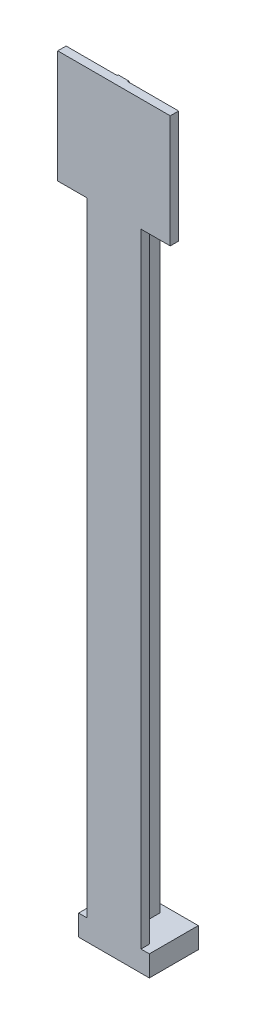
ISO-10303-21;
HEADER;
FILE_DESCRIPTION(('STEP AP214'),'2;1');
FILE_NAME('part.step','',(''),(''),'','','');
FILE_SCHEMA(('AUTOMOTIVE_DESIGN { 1 0 10303 214 1 1 1 1 }'));
ENDSEC;
DATA;
#1=APPLICATION_CONTEXT('core data for automotive mechanical design processes');
#2=APPLICATION_PROTOCOL_DEFINITION('international standard','automotive_design',2000,#1);
#3=PRODUCT_CONTEXT('',#1,'mechanical');
#4=PRODUCT('Part','Part','',(#3));
#5=PRODUCT_RELATED_PRODUCT_CATEGORY('part','',(#4));
#6=PRODUCT_DEFINITION_FORMATION('','',#4);
#7=PRODUCT_DEFINITION_CONTEXT('part definition',#1,'design');
#8=PRODUCT_DEFINITION('design','',#6,#7);
#9=PRODUCT_DEFINITION_SHAPE('','',#8);
#10=(LENGTH_UNIT() NAMED_UNIT(*) SI_UNIT(.MILLI.,.METRE.));
#11=(NAMED_UNIT(*) PLANE_ANGLE_UNIT() SI_UNIT($,.RADIAN.));
#12=(NAMED_UNIT(*) SI_UNIT($,.STERADIAN.) SOLID_ANGLE_UNIT());
#13=UNCERTAINTY_MEASURE_WITH_UNIT(LENGTH_MEASURE(1.E-05),#10,'distance_accuracy_value','');
#14=(GEOMETRIC_REPRESENTATION_CONTEXT(3) GLOBAL_UNCERTAINTY_ASSIGNED_CONTEXT((#13)) GLOBAL_UNIT_ASSIGNED_CONTEXT((#10,
#11,#12)) REPRESENTATION_CONTEXT('',''));
#15=CARTESIAN_POINT('',(0.,0.,0.));
#16=DIRECTION('',(0.,0.,1.));
#17=DIRECTION('',(1.,0.,0.));
#18=AXIS2_PLACEMENT_3D('',#15,#16,#17);
#19=CARTESIAN_POINT('',(0.,5.,0.));
#20=DIRECTION('',(0.,-1.,0.));
#21=DIRECTION('',(0.,0.,-1.));
#22=AXIS2_PLACEMENT_3D('',#19,#20,#21);
#23=PLANE('',#22);
#24=DIRECTION('',(0.,0.,1.));
#25=VECTOR('',#24,1.);
#26=CARTESIAN_POINT('',(2.,5.,0.));
#27=LINE('',#26,#25);
#28=CARTESIAN_POINT('',(2.,5.,-2.));
#29=VERTEX_POINT('',#28);
#30=CARTESIAN_POINT('',(2.,5.,0.));
#31=VERTEX_POINT('',#30);
#32=EDGE_CURVE('E256',#29,#31,#27,.T.);
#33=ORIENTED_EDGE('',*,*,#32,.F.);
#34=DIRECTION('',(-1.,0.,0.));
#35=VECTOR('',#34,1.);
#36=CARTESIAN_POINT('',(2.,5.,-2.));
#37=LINE('',#36,#35);
#38=CARTESIAN_POINT('',(7.2,5.,-2.));
#39=VERTEX_POINT('',#38);
#40=EDGE_CURVE('E280',#39,#29,#37,.T.);
#41=ORIENTED_EDGE('',*,*,#40,.F.);
#42=DIRECTION('',(0.,0.,1.));
#43=VECTOR('',#42,1.);
#44=CARTESIAN_POINT('',(7.2,5.,-2.));
#45=LINE('',#44,#43);
#46=CARTESIAN_POINT('',(7.2,5.,-9.7));
#47=VERTEX_POINT('',#46);
#48=EDGE_CURVE('E277',#47,#39,#45,.T.);
#49=ORIENTED_EDGE('',*,*,#48,.F.);
#50=DIRECTION('',(-1.,0.,0.));
#51=VECTOR('',#50,1.);
#52=CARTESIAN_POINT('',(7.2,5.,-9.7));
#53=LINE('',#52,#51);
#54=CARTESIAN_POINT('',(9.69999999999999,5.,-9.7));
#55=VERTEX_POINT('',#54);
#56=EDGE_CURVE('E274',#55,#47,#53,.T.);
#57=ORIENTED_EDGE('',*,*,#56,.F.);
#58=DIRECTION('',(0.,0.,-1.));
#59=VECTOR('',#58,1.);
#60=CARTESIAN_POINT('',(9.69999999999999,5.,-9.7));
#61=LINE('',#60,#59);
#62=CARTESIAN_POINT('',(9.7,5.,-2.));
#63=VERTEX_POINT('',#62);
#64=EDGE_CURVE('E271',#63,#55,#61,.T.);
#65=ORIENTED_EDGE('',*,*,#64,.F.);
#66=DIRECTION('',(-1.,0.,0.));
#67=VECTOR('',#66,1.);
#68=CARTESIAN_POINT('',(9.7,5.,-2.));
#69=LINE('',#68,#67);
#70=CARTESIAN_POINT('',(14.9,5.,-2.));
#71=VERTEX_POINT('',#70);
#72=EDGE_CURVE('E268',#71,#63,#69,.T.);
#73=ORIENTED_EDGE('',*,*,#72,.F.);
#74=DIRECTION('',(0.,0.,-1.));
#75=VECTOR('',#74,1.);
#76=CARTESIAN_POINT('',(14.9,5.,-2.));
#77=LINE('',#76,#75);
#78=CARTESIAN_POINT('',(14.9,5.,0.));
#79=VERTEX_POINT('',#78);
#80=EDGE_CURVE('E252',#79,#71,#77,.T.);
#81=ORIENTED_EDGE('',*,*,#80,.F.);
#82=DIRECTION('',(1.,0.,0.));
#83=VECTOR('',#82,1.);
#84=CARTESIAN_POINT('',(0.,5.,0.));
#85=LINE('',#84,#83);
#86=CARTESIAN_POINT('',(16.9,5.,0.));
#87=VERTEX_POINT('',#86);
#88=EDGE_CURVE('E366',#79,#87,#85,.T.);
#89=ORIENTED_EDGE('',*,*,#88,.T.);
#90=DIRECTION('',(0.,0.,-1.));
#91=VECTOR('',#90,1.);
#92=CARTESIAN_POINT('',(16.9,5.,0.));
#93=LINE('',#92,#91);
#94=CARTESIAN_POINT('',(16.9,5.,-11.7));
#95=VERTEX_POINT('',#94);
#96=EDGE_CURVE('E371',#87,#95,#93,.T.);
#97=ORIENTED_EDGE('',*,*,#96,.T.);
#98=DIRECTION('',(-1.,0.,0.));
#99=VECTOR('',#98,1.);
#100=CARTESIAN_POINT('',(0.,5.,-11.7));
#101=LINE('',#100,#99);
#102=CARTESIAN_POINT('',(0.,5.,-11.7));
#103=VERTEX_POINT('',#102);
#104=EDGE_CURVE('E373',#95,#103,#101,.T.);
#105=ORIENTED_EDGE('',*,*,#104,.T.);
#106=DIRECTION('',(0.,0.,1.));
#107=VECTOR('',#106,1.);
#108=CARTESIAN_POINT('',(0.,5.,0.));
#109=LINE('',#108,#107);
#110=CARTESIAN_POINT('',(0.,5.,0.));
#111=VERTEX_POINT('',#110);
#112=EDGE_CURVE('E363',#103,#111,#109,.T.);
#113=ORIENTED_EDGE('',*,*,#112,.T.);
#114=EDGE_CURVE('E368',#111,#31,#85,.T.);
#115=ORIENTED_EDGE('',*,*,#114,.T.);
#116=EDGE_LOOP('',(#33,#41,#49,#57,#65,#73,#81,#89,#97,#105,#113,#115));
#117=FACE_BOUND('',#116,.T.);
#118=ADVANCED_FACE('F38',(#117),#23,.F.);
#119=CARTESIAN_POINT('',(0.,5.,0.));
#120=DIRECTION('',(1.,0.,0.));
#121=DIRECTION('',(0.,0.,-1.));
#122=AXIS2_PLACEMENT_3D('',#119,#120,#121);
#123=PLANE('',#122);
#124=DIRECTION('',(0.,0.,1.));
#125=VECTOR('',#124,1.);
#126=CARTESIAN_POINT('',(0.,0.,0.));
#127=LINE('',#126,#125);
#128=CARTESIAN_POINT('',(0.,0.,-11.7));
#129=VERTEX_POINT('',#128);
#130=CARTESIAN_POINT('',(0.,0.,0.));
#131=VERTEX_POINT('',#130);
#132=EDGE_CURVE('E356',#129,#131,#127,.T.);
#133=ORIENTED_EDGE('',*,*,#132,.T.);
#134=DIRECTION('',(0.,-1.,0.));
#135=VECTOR('',#134,1.);
#136=CARTESIAN_POINT('',(0.,5.,0.));
#137=LINE('',#136,#135);
#138=EDGE_CURVE('E391',#111,#131,#137,.T.);
#139=ORIENTED_EDGE('',*,*,#138,.F.);
#140=ORIENTED_EDGE('',*,*,#112,.F.);
#141=DIRECTION('',(0.,-1.,0.));
#142=VECTOR('',#141,1.);
#143=CARTESIAN_POINT('',(0.,5.,-11.7));
#144=LINE('',#143,#142);
#145=EDGE_CURVE('E375',#103,#129,#144,.T.);
#146=ORIENTED_EDGE('',*,*,#145,.T.);
#147=EDGE_LOOP('',(#133,#139,#140,#146));
#148=FACE_BOUND('',#147,.T.);
#149=ADVANCED_FACE('F433',(#148),#123,.F.);
#150=CARTESIAN_POINT('',(0.,5.,0.));
#151=DIRECTION('',(0.,0.,-1.));
#152=DIRECTION('',(-1.,0.,0.));
#153=AXIS2_PLACEMENT_3D('',#150,#151,#152);
#154=PLANE('',#153);
#155=DIRECTION('',(0.,-1.,0.));
#156=VECTOR('',#155,1.);
#157=CARTESIAN_POINT('',(14.9,181.,0.));
#158=LINE('',#157,#156);
#159=CARTESIAN_POINT('',(14.9,154.05,0.));
#160=VERTEX_POINT('',#159);
#161=EDGE_CURVE('E296',#160,#79,#158,.T.);
#162=ORIENTED_EDGE('',*,*,#161,.F.);
#163=DIRECTION('',(1.,0.,0.));
#164=VECTOR('',#163,1.);
#165=CARTESIAN_POINT('',(-4.99999999999999,154.05,0.));
#166=LINE('',#165,#164);
#167=CARTESIAN_POINT('',(21.9,154.05,0.));
#168=VERTEX_POINT('',#167);
#169=EDGE_CURVE('E241',#160,#168,#166,.T.);
#170=ORIENTED_EDGE('',*,*,#169,.T.);
#171=DIRECTION('',(0.,1.,0.));
#172=VECTOR('',#171,1.);
#173=CARTESIAN_POINT('',(21.9,181.,0.));
#174=LINE('',#173,#172);
#175=CARTESIAN_POINT('',(21.9,181.,0.));
#176=VERTEX_POINT('',#175);
#177=EDGE_CURVE('E232',#168,#176,#174,.T.);
#178=ORIENTED_EDGE('',*,*,#177,.T.);
#179=DIRECTION('',(1.,0.,0.));
#180=VECTOR('',#179,1.);
#181=CARTESIAN_POINT('',(2.,181.,0.));
#182=LINE('',#181,#180);
#183=CARTESIAN_POINT('',(-5.,181.,0.));
#184=VERTEX_POINT('',#183);
#185=EDGE_CURVE('E253',#184,#176,#182,.T.);
#186=ORIENTED_EDGE('',*,*,#185,.F.);
#187=DIRECTION('',(0.,-1.,0.));
#188=VECTOR('',#187,1.);
#189=CARTESIAN_POINT('',(-5.,181.,0.));
#190=LINE('',#189,#188);
#191=CARTESIAN_POINT('',(-4.99999999999999,154.05,0.));
#192=VERTEX_POINT('',#191);
#193=EDGE_CURVE('E239',#184,#192,#190,.T.);
#194=ORIENTED_EDGE('',*,*,#193,.T.);
#195=CARTESIAN_POINT('',(2.,154.05,0.));
#196=VERTEX_POINT('',#195);
#197=EDGE_CURVE('E210',#192,#196,#166,.T.);
#198=ORIENTED_EDGE('',*,*,#197,.T.);
#199=DIRECTION('',(0.,-1.,0.));
#200=VECTOR('',#199,1.);
#201=CARTESIAN_POINT('',(2.,181.,0.));
#202=LINE('',#201,#200);
#203=EDGE_CURVE('E265',#196,#31,#202,.T.);
#204=ORIENTED_EDGE('',*,*,#203,.T.);
#205=ORIENTED_EDGE('',*,*,#114,.F.);
#206=ORIENTED_EDGE('',*,*,#138,.T.);
#207=DIRECTION('',(1.,0.,0.));
#208=VECTOR('',#207,1.);
#209=CARTESIAN_POINT('',(0.,0.,0.));
#210=LINE('',#209,#208);
#211=CARTESIAN_POINT('',(16.9,0.,0.));
#212=VERTEX_POINT('',#211);
#213=EDGE_CURVE('E378',#131,#212,#210,.T.);
#214=ORIENTED_EDGE('',*,*,#213,.T.);
#215=DIRECTION('',(0.,-1.,0.));
#216=VECTOR('',#215,1.);
#217=CARTESIAN_POINT('',(16.9,5.,0.));
#218=LINE('',#217,#216);
#219=EDGE_CURVE('E388',#87,#212,#218,.T.);
#220=ORIENTED_EDGE('',*,*,#219,.F.);
#221=ORIENTED_EDGE('',*,*,#88,.F.);
#222=EDGE_LOOP('',(#162,#170,#178,#186,#194,#198,#204,#205,#206,#214,#220,#221));
#223=FACE_BOUND('',#222,.T.);
#224=ADVANCED_FACE('F411',(#223),#154,.F.);
#225=CARTESIAN_POINT('',(16.9,5.,0.));
#226=DIRECTION('',(-1.,0.,0.));
#227=DIRECTION('',(0.,0.,1.));
#228=AXIS2_PLACEMENT_3D('',#225,#226,#227);
#229=PLANE('',#228);
#230=DIRECTION('',(0.,0.,-1.));
#231=VECTOR('',#230,1.);
#232=CARTESIAN_POINT('',(16.9,0.,0.));
#233=LINE('',#232,#231);
#234=CARTESIAN_POINT('',(16.9,0.,-11.7));
#235=VERTEX_POINT('',#234);
#236=EDGE_CURVE('E380',#212,#235,#233,.T.);
#237=ORIENTED_EDGE('',*,*,#236,.T.);
#238=DIRECTION('',(0.,-1.,0.));
#239=VECTOR('',#238,1.);
#240=CARTESIAN_POINT('',(16.9,5.,-11.7));
#241=LINE('',#240,#239);
#242=EDGE_CURVE('E385',#95,#235,#241,.T.);
#243=ORIENTED_EDGE('',*,*,#242,.F.);
#244=ORIENTED_EDGE('',*,*,#96,.F.);
#245=ORIENTED_EDGE('',*,*,#219,.T.);
#246=EDGE_LOOP('',(#237,#243,#244,#245));
#247=FACE_BOUND('',#246,.T.);
#248=ADVANCED_FACE('F452',(#247),#229,.F.);
#249=CARTESIAN_POINT('',(0.,5.,-11.7));
#250=DIRECTION('',(0.,0.,1.));
#251=DIRECTION('',(1.,0.,0.));
#252=AXIS2_PLACEMENT_3D('',#249,#250,#251);
#253=PLANE('',#252);
#254=DIRECTION('',(-1.,0.,0.));
#255=VECTOR('',#254,1.);
#256=CARTESIAN_POINT('',(0.,0.,-11.7));
#257=LINE('',#256,#255);
#258=EDGE_CURVE('E367',#235,#129,#257,.T.);
#259=ORIENTED_EDGE('',*,*,#258,.T.);
#260=ORIENTED_EDGE('',*,*,#145,.F.);
#261=ORIENTED_EDGE('',*,*,#104,.F.);
#262=ORIENTED_EDGE('',*,*,#242,.T.);
#263=EDGE_LOOP('',(#259,#260,#261,#262));
#264=FACE_BOUND('',#263,.T.);
#265=ADVANCED_FACE('F448',(#264),#253,.F.);
#266=CARTESIAN_POINT('',(0.,0.,0.));
#267=DIRECTION('',(0.,-1.,0.));
#268=DIRECTION('',(0.,0.,-1.));
#269=AXIS2_PLACEMENT_3D('',#266,#267,#268);
#270=PLANE('',#269);
#271=DIRECTION('',(0.,0.,-1.));
#272=VECTOR('',#271,1.);
#273=CARTESIAN_POINT('',(2.92499999999999,0.,-2.925));
#274=LINE('',#273,#272);
#275=CARTESIAN_POINT('',(2.92499999999999,0.,-2.925));
#276=VERTEX_POINT('',#275);
#277=CARTESIAN_POINT('',(2.92499999999999,0.,-8.775));
#278=VERTEX_POINT('',#277);
#279=EDGE_CURVE('E323',#276,#278,#274,.T.);
#280=ORIENTED_EDGE('',*,*,#279,.F.);
#281=DIRECTION('',(-1.,0.,0.));
#282=VECTOR('',#281,1.);
#283=CARTESIAN_POINT('',(2.92499999999999,0.,-2.925));
#284=LINE('',#283,#282);
#285=CARTESIAN_POINT('',(13.975,0.,-2.925));
#286=VERTEX_POINT('',#285);
#287=EDGE_CURVE('E335',#286,#276,#284,.T.);
#288=ORIENTED_EDGE('',*,*,#287,.F.);
#289=DIRECTION('',(0.,0.,1.));
#290=VECTOR('',#289,1.);
#291=CARTESIAN_POINT('',(13.975,0.,-2.925));
#292=LINE('',#291,#290);
#293=CARTESIAN_POINT('',(13.975,0.,-8.775));
#294=VERTEX_POINT('',#293);
#295=EDGE_CURVE('E349',#294,#286,#292,.T.);
#296=ORIENTED_EDGE('',*,*,#295,.F.);
#297=DIRECTION('',(1.,0.,0.));
#298=VECTOR('',#297,1.);
#299=CARTESIAN_POINT('',(2.92499999999999,0.,-8.775));
#300=LINE('',#299,#298);
#301=EDGE_CURVE('E346',#278,#294,#300,.T.);
#302=ORIENTED_EDGE('',*,*,#301,.F.);
#303=EDGE_LOOP('',(#280,#288,#296,#302));
#304=FACE_BOUND('',#303,.T.);
#305=ORIENTED_EDGE('',*,*,#132,.F.);
#306=ORIENTED_EDGE('',*,*,#258,.F.);
#307=ORIENTED_EDGE('',*,*,#236,.F.);
#308=ORIENTED_EDGE('',*,*,#213,.F.);
#309=EDGE_LOOP('',(#305,#306,#307,#308));
#310=FACE_BOUND('',#309,.T.);
#311=ADVANCED_FACE('F445',(#304,#310),#270,.T.);
#312=CARTESIAN_POINT('',(2.92499999999999,0.95,-2.925));
#313=DIRECTION('',(-1.,0.,0.));
#314=DIRECTION('',(0.,0.,1.));
#315=AXIS2_PLACEMENT_3D('',#312,#313,#314);
#316=PLANE('',#315);
#317=ORIENTED_EDGE('',*,*,#279,.T.);
#318=DIRECTION('',(0.,-1.,0.));
#319=VECTOR('',#318,1.);
#320=CARTESIAN_POINT('',(2.92499999999999,0.95,-8.775));
#321=LINE('',#320,#319);
#322=CARTESIAN_POINT('',(2.92499999999999,0.95,-8.775));
#323=VERTEX_POINT('',#322);
#324=EDGE_CURVE('E344',#323,#278,#321,.T.);
#325=ORIENTED_EDGE('',*,*,#324,.F.);
#326=DIRECTION('',(0.,0.,-1.));
#327=VECTOR('',#326,1.);
#328=CARTESIAN_POINT('',(2.92499999999999,0.95,-2.925));
#329=LINE('',#328,#327);
#330=CARTESIAN_POINT('',(2.92499999999999,0.95,-2.925));
#331=VERTEX_POINT('',#330);
#332=EDGE_CURVE('E331',#331,#323,#329,.T.);
#333=ORIENTED_EDGE('',*,*,#332,.F.);
#334=DIRECTION('',(0.,-1.,0.));
#335=VECTOR('',#334,1.);
#336=CARTESIAN_POINT('',(2.92499999999999,0.95,-2.925));
#337=LINE('',#336,#335);
#338=EDGE_CURVE('E354',#331,#276,#337,.T.);
#339=ORIENTED_EDGE('',*,*,#338,.T.);
#340=EDGE_LOOP('',(#317,#325,#333,#339));
#341=FACE_BOUND('',#340,.T.);
#342=ADVANCED_FACE('F443',(#341),#316,.F.);
#343=CARTESIAN_POINT('',(2.92499999999999,0.95,-2.925));
#344=DIRECTION('',(0.,0.,1.));
#345=DIRECTION('',(1.,0.,0.));
#346=AXIS2_PLACEMENT_3D('',#343,#344,#345);
#347=PLANE('',#346);
#348=ORIENTED_EDGE('',*,*,#287,.T.);
#349=ORIENTED_EDGE('',*,*,#338,.F.);
#350=DIRECTION('',(-1.,0.,0.));
#351=VECTOR('',#350,1.);
#352=CARTESIAN_POINT('',(2.92499999999999,0.95,-2.925));
#353=LINE('',#352,#351);
#354=CARTESIAN_POINT('',(13.975,0.95,-2.925));
#355=VERTEX_POINT('',#354);
#356=EDGE_CURVE('E341',#355,#331,#353,.T.);
#357=ORIENTED_EDGE('',*,*,#356,.F.);
#358=DIRECTION('',(0.,-1.,0.));
#359=VECTOR('',#358,1.);
#360=CARTESIAN_POINT('',(13.975,0.95,-2.925));
#361=LINE('',#360,#359);
#362=EDGE_CURVE('E357',#355,#286,#361,.T.);
#363=ORIENTED_EDGE('',*,*,#362,.T.);
#364=EDGE_LOOP('',(#348,#349,#357,#363));
#365=FACE_BOUND('',#364,.T.);
#366=ADVANCED_FACE('F481',(#365),#347,.F.);
#367=CARTESIAN_POINT('',(13.975,0.95,-2.925));
#368=DIRECTION('',(1.,0.,0.));
#369=DIRECTION('',(0.,0.,-1.));
#370=AXIS2_PLACEMENT_3D('',#367,#368,#369);
#371=PLANE('',#370);
#372=ORIENTED_EDGE('',*,*,#295,.T.);
#373=ORIENTED_EDGE('',*,*,#362,.F.);
#374=DIRECTION('',(0.,0.,1.));
#375=VECTOR('',#374,1.);
#376=CARTESIAN_POINT('',(13.975,0.95,-2.925));
#377=LINE('',#376,#375);
#378=CARTESIAN_POINT('',(13.975,0.95,-8.775));
#379=VERTEX_POINT('',#378);
#380=EDGE_CURVE('E338',#379,#355,#377,.T.);
#381=ORIENTED_EDGE('',*,*,#380,.F.);
#382=DIRECTION('',(0.,-1.,0.));
#383=VECTOR('',#382,1.);
#384=CARTESIAN_POINT('',(13.975,0.95,-8.775));
#385=LINE('',#384,#383);
#386=EDGE_CURVE('E359',#379,#294,#385,.T.);
#387=ORIENTED_EDGE('',*,*,#386,.T.);
#388=EDGE_LOOP('',(#372,#373,#381,#387));
#389=FACE_BOUND('',#388,.T.);
#390=ADVANCED_FACE('F488',(#389),#371,.F.);
#391=CARTESIAN_POINT('',(2.92499999999999,0.95,-8.775));
#392=DIRECTION('',(0.,0.,-1.));
#393=DIRECTION('',(-1.,0.,0.));
#394=AXIS2_PLACEMENT_3D('',#391,#392,#393);
#395=PLANE('',#394);
#396=ORIENTED_EDGE('',*,*,#301,.T.);
#397=ORIENTED_EDGE('',*,*,#386,.F.);
#398=DIRECTION('',(1.,0.,0.));
#399=VECTOR('',#398,1.);
#400=CARTESIAN_POINT('',(2.92499999999999,0.95,-8.775));
#401=LINE('',#400,#399);
#402=EDGE_CURVE('E334',#323,#379,#401,.T.);
#403=ORIENTED_EDGE('',*,*,#402,.F.);
#404=ORIENTED_EDGE('',*,*,#324,.T.);
#405=EDGE_LOOP('',(#396,#397,#403,#404));
#406=FACE_BOUND('',#405,.T.);
#407=ADVANCED_FACE('F496',(#406),#395,.F.);
#408=CARTESIAN_POINT('',(0.,0.95,0.));
#409=DIRECTION('',(0.,-1.,0.));
#410=DIRECTION('',(0.,0.,-1.));
#411=AXIS2_PLACEMENT_3D('',#408,#409,#410);
#412=PLANE('',#411);
#413=ORIENTED_EDGE('',*,*,#332,.T.);
#414=ORIENTED_EDGE('',*,*,#402,.T.);
#415=ORIENTED_EDGE('',*,*,#380,.T.);
#416=ORIENTED_EDGE('',*,*,#356,.T.);
#417=EDGE_LOOP('',(#413,#414,#415,#416));
#418=FACE_BOUND('',#417,.T.);
#419=ADVANCED_FACE('F504',(#418),#412,.T.);
#420=CARTESIAN_POINT('',(14.9,181.,-2.));
#421=DIRECTION('',(-1.,0.,0.));
#422=DIRECTION('',(0.,0.,1.));
#423=AXIS2_PLACEMENT_3D('',#420,#421,#422);
#424=PLANE('',#423);
#425=DIRECTION('',(0.,-1.,0.));
#426=VECTOR('',#425,1.);
#427=CARTESIAN_POINT('',(14.9,181.,-2.));
#428=LINE('',#427,#426);
#429=CARTESIAN_POINT('',(14.9,154.05,-2.));
#430=VERTEX_POINT('',#429);
#431=EDGE_CURVE('E294',#430,#71,#428,.T.);
#432=ORIENTED_EDGE('',*,*,#431,.F.);
#433=DIRECTION('',(0.,0.,1.));
#434=VECTOR('',#433,1.);
#435=CARTESIAN_POINT('',(14.9,154.05,-2.));
#436=LINE('',#435,#434);
#437=EDGE_CURVE('E244',#430,#160,#436,.T.);
#438=ORIENTED_EDGE('',*,*,#437,.T.);
#439=ORIENTED_EDGE('',*,*,#161,.T.);
#440=ORIENTED_EDGE('',*,*,#80,.T.);
#441=EDGE_LOOP('',(#432,#438,#439,#440));
#442=FACE_BOUND('',#441,.T.);
#443=ADVANCED_FACE('F512',(#442),#424,.F.);
#444=CARTESIAN_POINT('',(9.7,181.,-2.));
#445=DIRECTION('',(0.,0.,1.));
#446=DIRECTION('',(1.,0.,0.));
#447=AXIS2_PLACEMENT_3D('',#444,#445,#446);
#448=PLANE('',#447);
#449=ORIENTED_EDGE('',*,*,#72,.T.);
#450=DIRECTION('',(0.,-1.,0.));
#451=VECTOR('',#450,1.);
#452=CARTESIAN_POINT('',(9.7,181.,-2.));
#453=LINE('',#452,#451);
#454=CARTESIAN_POINT('',(9.7,181.,-2.));
#455=VERTEX_POINT('',#454);
#456=EDGE_CURVE('E292',#455,#63,#453,.T.);
#457=ORIENTED_EDGE('',*,*,#456,.F.);
#458=DIRECTION('',(-1.,0.,0.));
#459=VECTOR('',#458,1.);
#460=CARTESIAN_POINT('',(9.7,181.,-2.));
#461=LINE('',#460,#459);
#462=CARTESIAN_POINT('',(21.9,181.,-2.));
#463=VERTEX_POINT('',#462);
#464=EDGE_CURVE('E255',#463,#455,#461,.T.);
#465=ORIENTED_EDGE('',*,*,#464,.F.);
#466=DIRECTION('',(0.,1.,0.));
#467=VECTOR('',#466,1.);
#468=CARTESIAN_POINT('',(21.9,181.,-2.));
#469=LINE('',#468,#467);
#470=CARTESIAN_POINT('',(21.9,154.05,-2.));
#471=VERTEX_POINT('',#470);
#472=EDGE_CURVE('E216',#471,#463,#469,.T.);
#473=ORIENTED_EDGE('',*,*,#472,.F.);
#474=DIRECTION('',(1.,0.,0.));
#475=VECTOR('',#474,1.);
#476=CARTESIAN_POINT('',(-4.99999999999999,154.05,-2.));
#477=LINE('',#476,#475);
#478=EDGE_CURVE('E226',#430,#471,#477,.T.);
#479=ORIENTED_EDGE('',*,*,#478,.F.);
#480=ORIENTED_EDGE('',*,*,#431,.T.);
#481=EDGE_LOOP('',(#449,#457,#465,#473,#479,#480));
#482=FACE_BOUND('',#481,.T.);
#483=ADVANCED_FACE('F420',(#482),#448,.F.);
#484=CARTESIAN_POINT('',(9.69999999999999,181.,-9.7));
#485=DIRECTION('',(-1.,0.,0.));
#486=DIRECTION('',(0.,0.,1.));
#487=AXIS2_PLACEMENT_3D('',#484,#485,#486);
#488=PLANE('',#487);
#489=DIRECTION('',(0.,-1.,0.));
#490=VECTOR('',#489,1.);
#491=CARTESIAN_POINT('',(9.69999999999999,181.,-9.7));
#492=LINE('',#491,#490);
#493=CARTESIAN_POINT('',(9.69999999999999,167.,-9.7));
#494=VERTEX_POINT('',#493);
#495=EDGE_CURVE('E290',#494,#55,#492,.T.);
#496=ORIENTED_EDGE('',*,*,#495,.F.);
#497=DIRECTION('',(0.,-0.882947592858928,-0.469471562785889));
#498=VECTOR('',#497,1.);
#499=CARTESIAN_POINT('',(9.7,181.,-2.25606795673927));
#500=LINE('',#499,#498);
#501=CARTESIAN_POINT('',(9.7,181.,-2.25606795673927));
#502=VERTEX_POINT('',#501);
#503=EDGE_CURVE('E11',#494,#502,#500,.F.);
#504=ORIENTED_EDGE('',*,*,#503,.T.);
#505=DIRECTION('',(0.,0.,-1.));
#506=VECTOR('',#505,1.);
#507=CARTESIAN_POINT('',(9.69999999999999,181.,-9.7));
#508=LINE('',#507,#506);
#509=EDGE_CURVE('E258',#455,#502,#508,.T.);
#510=ORIENTED_EDGE('',*,*,#509,.F.);
#511=ORIENTED_EDGE('',*,*,#456,.T.);
#512=ORIENTED_EDGE('',*,*,#64,.T.);
#513=EDGE_LOOP('',(#496,#504,#510,#511,#512));
#514=FACE_BOUND('',#513,.T.);
#515=ADVANCED_FACE('F424',(#514),#488,.F.);
#516=CARTESIAN_POINT('',(7.2,181.,-9.7));
#517=DIRECTION('',(0.,0.,1.));
#518=DIRECTION('',(1.,0.,0.));
#519=AXIS2_PLACEMENT_3D('',#516,#517,#518);
#520=PLANE('',#519);
#521=DIRECTION('',(0.,-1.,0.));
#522=VECTOR('',#521,1.);
#523=CARTESIAN_POINT('',(7.2,181.,-9.7));
#524=LINE('',#523,#522);
#525=CARTESIAN_POINT('',(7.2,167.,-9.7));
#526=VERTEX_POINT('',#525);
#527=EDGE_CURVE('E288',#526,#47,#524,.T.);
#528=ORIENTED_EDGE('',*,*,#527,.F.);
#529=DIRECTION('',(1.,0.,0.));
#530=VECTOR('',#529,1.);
#531=CARTESIAN_POINT('',(7.2,167.,-9.7));
#532=LINE('',#531,#530);
#533=EDGE_CURVE('E48',#526,#494,#532,.T.);
#534=ORIENTED_EDGE('',*,*,#533,.T.);
#535=ORIENTED_EDGE('',*,*,#495,.T.);
#536=ORIENTED_EDGE('',*,*,#56,.T.);
#537=EDGE_LOOP('',(#528,#534,#535,#536));
#538=FACE_BOUND('',#537,.T.);
#539=ADVANCED_FACE('F534',(#538),#520,.F.);
#540=CARTESIAN_POINT('',(7.2,181.,-2.));
#541=DIRECTION('',(1.,0.,0.));
#542=DIRECTION('',(0.,0.,-1.));
#543=AXIS2_PLACEMENT_3D('',#540,#541,#542);
#544=PLANE('',#543);
#545=DIRECTION('',(0.,0.,1.));
#546=VECTOR('',#545,1.);
#547=CARTESIAN_POINT('',(7.2,181.,-2.));
#548=LINE('',#547,#546);
#549=CARTESIAN_POINT('',(7.2,181.,-2.25606795673927));
#550=VERTEX_POINT('',#549);
#551=CARTESIAN_POINT('',(7.2,181.,-2.));
#552=VERTEX_POINT('',#551);
#553=EDGE_CURVE('E261',#550,#552,#548,.T.);
#554=ORIENTED_EDGE('',*,*,#553,.F.);
#555=DIRECTION('',(0.,0.882947592858928,0.469471562785889));
#556=VECTOR('',#555,1.);
#557=CARTESIAN_POINT('',(7.2,181.,-2.25606795673927));
#558=LINE('',#557,#556);
#559=EDGE_CURVE('E62',#550,#526,#558,.F.);
#560=ORIENTED_EDGE('',*,*,#559,.T.);
#561=ORIENTED_EDGE('',*,*,#527,.T.);
#562=ORIENTED_EDGE('',*,*,#48,.T.);
#563=DIRECTION('',(0.,-1.,0.));
#564=VECTOR('',#563,1.);
#565=CARTESIAN_POINT('',(7.2,181.,-2.));
#566=LINE('',#565,#564);
#567=EDGE_CURVE('E286',#552,#39,#566,.T.);
#568=ORIENTED_EDGE('',*,*,#567,.F.);
#569=EDGE_LOOP('',(#554,#560,#561,#562,#568));
#570=FACE_BOUND('',#569,.T.);
#571=ADVANCED_FACE('F406',(#570),#544,.F.);
#572=CARTESIAN_POINT('',(2.,181.,-2.));
#573=DIRECTION('',(0.,0.,1.));
#574=DIRECTION('',(1.,0.,0.));
#575=AXIS2_PLACEMENT_3D('',#572,#573,#574);
#576=PLANE('',#575);
#577=DIRECTION('',(0.,-1.,0.));
#578=VECTOR('',#577,1.);
#579=CARTESIAN_POINT('',(2.,181.,-2.));
#580=LINE('',#579,#578);
#581=CARTESIAN_POINT('',(2.,154.05,-2.));
#582=VERTEX_POINT('',#581);
#583=EDGE_CURVE('E225',#582,#29,#580,.T.);
#584=ORIENTED_EDGE('',*,*,#583,.F.);
#585=CARTESIAN_POINT('',(-4.99999999999999,154.05,-2.));
#586=VERTEX_POINT('',#585);
#587=EDGE_CURVE('E208',#586,#582,#477,.T.);
#588=ORIENTED_EDGE('',*,*,#587,.F.);
#589=DIRECTION('',(0.,-1.,0.));
#590=VECTOR('',#589,1.);
#591=CARTESIAN_POINT('',(-5.,181.,-2.));
#592=LINE('',#591,#590);
#593=CARTESIAN_POINT('',(-5.,181.,-2.));
#594=VERTEX_POINT('',#593);
#595=EDGE_CURVE('E223',#594,#586,#592,.T.);
#596=ORIENTED_EDGE('',*,*,#595,.F.);
#597=DIRECTION('',(-1.,0.,0.));
#598=VECTOR('',#597,1.);
#599=CARTESIAN_POINT('',(2.,181.,-2.));
#600=LINE('',#599,#598);
#601=EDGE_CURVE('E263',#552,#594,#600,.T.);
#602=ORIENTED_EDGE('',*,*,#601,.F.);
#603=ORIENTED_EDGE('',*,*,#567,.T.);
#604=ORIENTED_EDGE('',*,*,#40,.T.);
#605=EDGE_LOOP('',(#584,#588,#596,#602,#603,#604));
#606=FACE_BOUND('',#605,.T.);
#607=ADVANCED_FACE('F221',(#606),#576,.F.);
#608=CARTESIAN_POINT('',(2.,181.,0.));
#609=DIRECTION('',(1.,0.,0.));
#610=DIRECTION('',(0.,0.,-1.));
#611=AXIS2_PLACEMENT_3D('',#608,#609,#610);
#612=PLANE('',#611);
#613=ORIENTED_EDGE('',*,*,#203,.F.);
#614=DIRECTION('',(0.,0.,-1.));
#615=VECTOR('',#614,1.);
#616=CARTESIAN_POINT('',(2.,154.05,0.));
#617=LINE('',#616,#615);
#618=EDGE_CURVE('E394',#196,#582,#617,.T.);
#619=ORIENTED_EDGE('',*,*,#618,.T.);
#620=ORIENTED_EDGE('',*,*,#583,.T.);
#621=ORIENTED_EDGE('',*,*,#32,.T.);
#622=EDGE_LOOP('',(#613,#619,#620,#621));
#623=FACE_BOUND('',#622,.T.);
#624=ADVANCED_FACE('F554',(#623),#612,.F.);
#625=CARTESIAN_POINT('',(0.,181.,0.));
#626=DIRECTION('',(0.,-1.,0.));
#627=DIRECTION('',(0.,0.,-1.));
#628=AXIS2_PLACEMENT_3D('',#625,#626,#627);
#629=PLANE('',#628);
#630=ORIENTED_EDGE('',*,*,#509,.T.);
#631=DIRECTION('',(-1.,0.,0.));
#632=VECTOR('',#631,1.);
#633=CARTESIAN_POINT('',(0.,181.,-2.25606795673927));
#634=LINE('',#633,#632);
#635=EDGE_CURVE('E396',#502,#550,#634,.T.);
#636=ORIENTED_EDGE('',*,*,#635,.T.);
#637=ORIENTED_EDGE('',*,*,#553,.T.);
#638=ORIENTED_EDGE('',*,*,#601,.T.);
#639=DIRECTION('',(0.,0.,1.));
#640=VECTOR('',#639,1.);
#641=CARTESIAN_POINT('',(-5.,181.,-2.));
#642=LINE('',#641,#640);
#643=EDGE_CURVE('E231',#594,#184,#642,.T.);
#644=ORIENTED_EDGE('',*,*,#643,.T.);
#645=ORIENTED_EDGE('',*,*,#185,.T.);
#646=DIRECTION('',(0.,0.,1.));
#647=VECTOR('',#646,1.);
#648=CARTESIAN_POINT('',(21.9,181.,-2.));
#649=LINE('',#648,#647);
#650=EDGE_CURVE('E245',#463,#176,#649,.T.);
#651=ORIENTED_EDGE('',*,*,#650,.F.);
#652=ORIENTED_EDGE('',*,*,#464,.T.);
#653=EDGE_LOOP('',(#630,#636,#637,#638,#644,#645,#651,#652));
#654=FACE_BOUND('',#653,.T.);
#655=ADVANCED_FACE('F401',(#654),#629,.F.);
#656=CARTESIAN_POINT('',(-5.,181.,-2.));
#657=DIRECTION('',(-1.,0.,0.));
#658=DIRECTION('',(0.,-1.,0.));
#659=AXIS2_PLACEMENT_3D('',#656,#657,#658);
#660=PLANE('',#659);
#661=ORIENTED_EDGE('',*,*,#193,.F.);
#662=ORIENTED_EDGE('',*,*,#643,.F.);
#663=ORIENTED_EDGE('',*,*,#595,.T.);
#664=DIRECTION('',(0.,0.,1.));
#665=VECTOR('',#664,1.);
#666=CARTESIAN_POINT('',(-4.99999999999999,154.05,-2.));
#667=LINE('',#666,#665);
#668=EDGE_CURVE('E204',#586,#192,#667,.T.);
#669=ORIENTED_EDGE('',*,*,#668,.T.);
#670=EDGE_LOOP('',(#661,#662,#663,#669));
#671=FACE_BOUND('',#670,.T.);
#672=ADVANCED_FACE('F229',(#671),#660,.T.);
#673=CARTESIAN_POINT('',(-4.99999999999999,154.05,-2.));
#674=DIRECTION('',(0.,-1.,0.));
#675=DIRECTION('',(0.,0.,-1.));
#676=AXIS2_PLACEMENT_3D('',#673,#674,#675);
#677=PLANE('',#676);
#678=ORIENTED_EDGE('',*,*,#618,.F.);
#679=ORIENTED_EDGE('',*,*,#197,.F.);
#680=ORIENTED_EDGE('',*,*,#668,.F.);
#681=ORIENTED_EDGE('',*,*,#587,.T.);
#682=EDGE_LOOP('',(#678,#679,#680,#681));
#683=FACE_BOUND('',#682,.T.);
#684=ADVANCED_FACE('F207',(#683),#677,.T.);
#685=ORIENTED_EDGE('',*,*,#437,.F.);
#686=ORIENTED_EDGE('',*,*,#478,.T.);
#687=DIRECTION('',(0.,0.,1.));
#688=VECTOR('',#687,1.);
#689=CARTESIAN_POINT('',(21.9,154.05,-2.));
#690=LINE('',#689,#688);
#691=EDGE_CURVE('E215',#471,#168,#690,.T.);
#692=ORIENTED_EDGE('',*,*,#691,.T.);
#693=ORIENTED_EDGE('',*,*,#169,.F.);
#694=EDGE_LOOP('',(#685,#686,#692,#693));
#695=FACE_BOUND('',#694,.T.);
#696=ADVANCED_FACE('F430',(#695),#677,.T.);
#697=CARTESIAN_POINT('',(21.9,181.,-2.));
#698=DIRECTION('',(1.,0.,0.));
#699=DIRECTION('',(0.,0.,-1.));
#700=AXIS2_PLACEMENT_3D('',#697,#698,#699);
#701=PLANE('',#700);
#702=ORIENTED_EDGE('',*,*,#177,.F.);
#703=ORIENTED_EDGE('',*,*,#691,.F.);
#704=ORIENTED_EDGE('',*,*,#472,.T.);
#705=ORIENTED_EDGE('',*,*,#650,.T.);
#706=EDGE_LOOP('',(#702,#703,#704,#705));
#707=FACE_BOUND('',#706,.T.);
#708=ADVANCED_FACE('F416',(#707),#701,.T.);
#709=CARTESIAN_POINT('',(0.,181.,-2.25606795673927));
#710=DIRECTION('',(0.,-0.469471562785889,0.882947592858928));
#711=DIRECTION('',(-1.,0.,0.));
#712=AXIS2_PLACEMENT_3D('',#709,#710,#711);
#713=PLANE('',#712);
#714=ORIENTED_EDGE('',*,*,#503,.F.);
#715=ORIENTED_EDGE('',*,*,#533,.F.);
#716=ORIENTED_EDGE('',*,*,#559,.F.);
#717=ORIENTED_EDGE('',*,*,#635,.F.);
#718=EDGE_LOOP('',(#714,#715,#716,#717));
#719=FACE_BOUND('',#718,.T.);
#720=ADVANCED_FACE('F41',(#719),#713,.F.);
#721=CLOSED_SHELL('',(#118,#149,#224,#248,#265,#311,#342,#366,#390,#407,#419,#443,#483,#515,
#539,#571,#607,#624,#655,#672,#684,#696,#708,#720));
#722=CARTESIAN_POINT('',(0.,1.95,0.));
#723=DIRECTION('',(0.,-1.,0.));
#724=DIRECTION('',(0.,0.,-1.));
#725=AXIS2_PLACEMENT_3D('',#722,#723,#724);
#726=PLANE('',#725);
#727=DIRECTION('',(0.,0.,-1.));
#728=VECTOR('',#727,1.);
#729=CARTESIAN_POINT('',(3.375,1.95,-3.325));
#730=LINE('',#729,#728);
#731=CARTESIAN_POINT('',(3.375,1.95,-3.325));
#732=VERTEX_POINT('',#731);
#733=CARTESIAN_POINT('',(3.375,1.95,-8.425));
#734=VERTEX_POINT('',#733);
#735=EDGE_CURVE('E298',#732,#734,#730,.T.);
#736=ORIENTED_EDGE('',*,*,#735,.F.);
#737=DIRECTION('',(-1.,0.,0.));
#738=VECTOR('',#737,1.);
#739=CARTESIAN_POINT('',(3.375,1.95,-3.325));
#740=LINE('',#739,#738);
#741=CARTESIAN_POINT('',(13.575,1.95,-3.325));
#742=VERTEX_POINT('',#741);
#743=EDGE_CURVE('E305',#742,#732,#740,.T.);
#744=ORIENTED_EDGE('',*,*,#743,.F.);
#745=DIRECTION('',(0.,0.,1.));
#746=VECTOR('',#745,1.);
#747=CARTESIAN_POINT('',(13.575,1.95,-3.325));
#748=LINE('',#747,#746);
#749=CARTESIAN_POINT('',(13.575,1.95,-8.425));
#750=VERTEX_POINT('',#749);
#751=EDGE_CURVE('E303',#750,#742,#748,.T.);
#752=ORIENTED_EDGE('',*,*,#751,.F.);
#753=DIRECTION('',(1.,0.,0.));
#754=VECTOR('',#753,1.);
#755=CARTESIAN_POINT('',(3.375,1.95,-8.425));
#756=LINE('',#755,#754);
#757=EDGE_CURVE('E301',#734,#750,#756,.T.);
#758=ORIENTED_EDGE('',*,*,#757,.F.);
#759=EDGE_LOOP('',(#736,#744,#752,#758));
#760=FACE_BOUND('',#759,.T.);
#761=ADVANCED_FACE('F634',(#760),#726,.F.);
#762=CARTESIAN_POINT('',(0.,3.95,0.));
#763=DIRECTION('',(0.,-1.,0.));
#764=DIRECTION('',(0.,0.,-1.));
#765=AXIS2_PLACEMENT_3D('',#762,#763,#764);
#766=PLANE('',#765);
#767=DIRECTION('',(0.,0.,-1.));
#768=VECTOR('',#767,1.);
#769=CARTESIAN_POINT('',(3.375,3.95,-3.325));
#770=LINE('',#769,#768);
#771=CARTESIAN_POINT('',(3.375,3.95,-3.325));
#772=VERTEX_POINT('',#771);
#773=CARTESIAN_POINT('',(3.375,3.95,-8.425));
#774=VERTEX_POINT('',#773);
#775=EDGE_CURVE('E307',#772,#774,#770,.T.);
#776=ORIENTED_EDGE('',*,*,#775,.T.);
#777=DIRECTION('',(1.,0.,0.));
#778=VECTOR('',#777,1.);
#779=CARTESIAN_POINT('',(3.375,3.95,-8.425));
#780=LINE('',#779,#778);
#781=CARTESIAN_POINT('',(13.575,3.95,-8.425));
#782=VERTEX_POINT('',#781);
#783=EDGE_CURVE('E310',#774,#782,#780,.T.);
#784=ORIENTED_EDGE('',*,*,#783,.T.);
#785=DIRECTION('',(0.,0.,1.));
#786=VECTOR('',#785,1.);
#787=CARTESIAN_POINT('',(13.575,3.95,-3.325));
#788=LINE('',#787,#786);
#789=CARTESIAN_POINT('',(13.575,3.95,-3.325));
#790=VERTEX_POINT('',#789);
#791=EDGE_CURVE('E313',#782,#790,#788,.T.);
#792=ORIENTED_EDGE('',*,*,#791,.T.);
#793=DIRECTION('',(-1.,0.,0.));
#794=VECTOR('',#793,1.);
#795=CARTESIAN_POINT('',(3.375,3.95,-3.325));
#796=LINE('',#795,#794);
#797=EDGE_CURVE('E316',#790,#772,#796,.T.);
#798=ORIENTED_EDGE('',*,*,#797,.T.);
#799=EDGE_LOOP('',(#776,#784,#792,#798));
#800=FACE_BOUND('',#799,.T.);
#801=ADVANCED_FACE('F637',(#800),#766,.T.);
#802=CARTESIAN_POINT('',(3.375,3.95,-8.425));
#803=DIRECTION('',(0.,0.,-1.));
#804=DIRECTION('',(-1.,0.,0.));
#805=AXIS2_PLACEMENT_3D('',#802,#803,#804);
#806=PLANE('',#805);
#807=ORIENTED_EDGE('',*,*,#757,.T.);
#808=DIRECTION('',(0.,-1.,0.));
#809=VECTOR('',#808,1.);
#810=CARTESIAN_POINT('',(13.575,3.95,-8.425));
#811=LINE('',#810,#809);
#812=EDGE_CURVE('E327',#782,#750,#811,.T.);
#813=ORIENTED_EDGE('',*,*,#812,.F.);
#814=ORIENTED_EDGE('',*,*,#783,.F.);
#815=DIRECTION('',(0.,-1.,0.));
#816=VECTOR('',#815,1.);
#817=CARTESIAN_POINT('',(3.375,3.95,-8.425));
#818=LINE('',#817,#816);
#819=EDGE_CURVE('E319',#774,#734,#818,.T.);
#820=ORIENTED_EDGE('',*,*,#819,.T.);
#821=EDGE_LOOP('',(#807,#813,#814,#820));
#822=FACE_BOUND('',#821,.T.);
#823=ADVANCED_FACE('F673',(#822),#806,.F.);
#824=CARTESIAN_POINT('',(13.575,3.95,-3.325));
#825=DIRECTION('',(1.,0.,0.));
#826=DIRECTION('',(0.,0.,-1.));
#827=AXIS2_PLACEMENT_3D('',#824,#825,#826);
#828=PLANE('',#827);
#829=ORIENTED_EDGE('',*,*,#751,.T.);
#830=DIRECTION('',(0.,-1.,0.));
#831=VECTOR('',#830,1.);
#832=CARTESIAN_POINT('',(13.575,3.95,-3.325));
#833=LINE('',#832,#831);
#834=EDGE_CURVE('E324',#790,#742,#833,.T.);
#835=ORIENTED_EDGE('',*,*,#834,.F.);
#836=ORIENTED_EDGE('',*,*,#791,.F.);
#837=ORIENTED_EDGE('',*,*,#812,.T.);
#838=EDGE_LOOP('',(#829,#835,#836,#837));
#839=FACE_BOUND('',#838,.T.);
#840=ADVANCED_FACE('F664',(#839),#828,.F.);
#841=CARTESIAN_POINT('',(3.375,3.95,-3.325));
#842=DIRECTION('',(0.,0.,1.));
#843=DIRECTION('',(1.,0.,0.));
#844=AXIS2_PLACEMENT_3D('',#841,#842,#843);
#845=PLANE('',#844);
#846=ORIENTED_EDGE('',*,*,#743,.T.);
#847=DIRECTION('',(0.,-1.,0.));
#848=VECTOR('',#847,1.);
#849=CARTESIAN_POINT('',(3.375,3.95,-3.325));
#850=LINE('',#849,#848);
#851=EDGE_CURVE('E320',#772,#732,#850,.T.);
#852=ORIENTED_EDGE('',*,*,#851,.F.);
#853=ORIENTED_EDGE('',*,*,#797,.F.);
#854=ORIENTED_EDGE('',*,*,#834,.T.);
#855=EDGE_LOOP('',(#846,#852,#853,#854));
#856=FACE_BOUND('',#855,.T.);
#857=ADVANCED_FACE('F655',(#856),#845,.F.);
#858=CARTESIAN_POINT('',(3.375,3.95,-3.325));
#859=DIRECTION('',(-1.,0.,0.));
#860=DIRECTION('',(0.,0.,1.));
#861=AXIS2_PLACEMENT_3D('',#858,#859,#860);
#862=PLANE('',#861);
#863=ORIENTED_EDGE('',*,*,#735,.T.);
#864=ORIENTED_EDGE('',*,*,#819,.F.);
#865=ORIENTED_EDGE('',*,*,#775,.F.);
#866=ORIENTED_EDGE('',*,*,#851,.T.);
#867=EDGE_LOOP('',(#863,#864,#865,#866));
#868=FACE_BOUND('',#867,.T.);
#869=ADVANCED_FACE('F650',(#868),#862,.F.);
#870=CLOSED_SHELL('',(#761,#801,#823,#840,#857,#869));
#871=ORIENTED_CLOSED_SHELL('',*,#870,.T.);
#872=BREP_WITH_VOIDS('B2',#721,(#871));
#873=ADVANCED_BREP_SHAPE_REPRESENTATION('',(#18,#872),#14);
#874=SHAPE_DEFINITION_REPRESENTATION(#9,#873);
ENDSEC;
END-ISO-10303-21;
